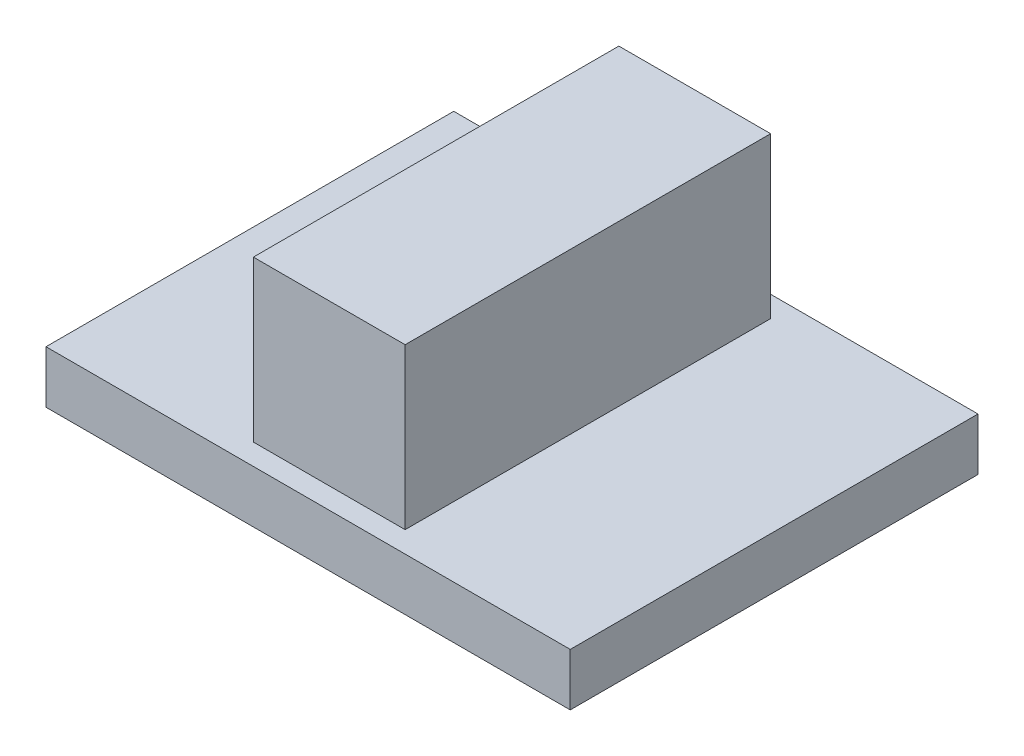
ISO-10303-21;
HEADER;
FILE_DESCRIPTION(('STEP AP214'),'2;1');
FILE_NAME('part.step','',(''),(''),'','','');
FILE_SCHEMA(('AUTOMOTIVE_DESIGN { 1 0 10303 214 1 1 1 1 }'));
ENDSEC;
DATA;
#1=APPLICATION_CONTEXT('core data for automotive mechanical design processes');
#2=APPLICATION_PROTOCOL_DEFINITION('international standard','automotive_design',2000,#1);
#3=PRODUCT_CONTEXT('',#1,'mechanical');
#4=PRODUCT('Part','Part','',(#3));
#5=PRODUCT_RELATED_PRODUCT_CATEGORY('part','',(#4));
#6=PRODUCT_DEFINITION_FORMATION('','',#4);
#7=PRODUCT_DEFINITION_CONTEXT('part definition',#1,'design');
#8=PRODUCT_DEFINITION('design','',#6,#7);
#9=PRODUCT_DEFINITION_SHAPE('','',#8);
#10=(LENGTH_UNIT() NAMED_UNIT(*) SI_UNIT(.MILLI.,.METRE.));
#11=(NAMED_UNIT(*) PLANE_ANGLE_UNIT() SI_UNIT($,.RADIAN.));
#12=(NAMED_UNIT(*) SI_UNIT($,.STERADIAN.) SOLID_ANGLE_UNIT());
#13=UNCERTAINTY_MEASURE_WITH_UNIT(LENGTH_MEASURE(1.E-05),#10,'distance_accuracy_value','');
#14=(GEOMETRIC_REPRESENTATION_CONTEXT(3) GLOBAL_UNCERTAINTY_ASSIGNED_CONTEXT((#13)) GLOBAL_UNIT_ASSIGNED_CONTEXT((#10,
#11,#12)) REPRESENTATION_CONTEXT('',''));
#15=CARTESIAN_POINT('',(0.,0.,0.));
#16=DIRECTION('',(0.,0.,1.));
#17=DIRECTION('',(1.,0.,0.));
#18=AXIS2_PLACEMENT_3D('',#15,#16,#17);
#19=CARTESIAN_POINT('',(0.,7.3,0.));
#20=DIRECTION('',(0.,-1.,0.));
#21=DIRECTION('',(0.,0.,-1.));
#22=AXIS2_PLACEMENT_3D('',#19,#20,#21);
#23=PLANE('',#22);
#24=DIRECTION('',(0.,0.,-1.));
#25=VECTOR('',#24,1.);
#26=CARTESIAN_POINT('',(2.6051126105191,7.3,6.2745090314332));
#27=LINE('',#26,#25);
#28=CARTESIAN_POINT('',(2.6051126105191,7.3,6.2745090314332));
#29=VERTEX_POINT('',#28);
#30=CARTESIAN_POINT('',(2.6051126105191,7.3,-6.2745090314332));
#31=VERTEX_POINT('',#30);
#32=EDGE_CURVE('E152',#29,#31,#27,.T.);
#33=ORIENTED_EDGE('',*,*,#32,.T.);
#34=DIRECTION('',(-1.,0.,0.));
#35=VECTOR('',#34,1.);
#36=CARTESIAN_POINT('',(-2.6051126105191,7.3,-6.2745090314332));
#37=LINE('',#36,#35);
#38=CARTESIAN_POINT('',(-2.6051126105191,7.3,-6.2745090314332));
#39=VERTEX_POINT('',#38);
#40=EDGE_CURVE('E149',#31,#39,#37,.T.);
#41=ORIENTED_EDGE('',*,*,#40,.T.);
#42=DIRECTION('',(0.,0.,1.));
#43=VECTOR('',#42,1.);
#44=CARTESIAN_POINT('',(-2.6051126105191,7.3,6.2745090314332));
#45=LINE('',#44,#43);
#46=CARTESIAN_POINT('',(-2.6051126105191,7.3,6.2745090314332));
#47=VERTEX_POINT('',#46);
#48=EDGE_CURVE('E26',#39,#47,#45,.T.);
#49=ORIENTED_EDGE('',*,*,#48,.T.);
#50=DIRECTION('',(1.,0.,0.));
#51=VECTOR('',#50,1.);
#52=CARTESIAN_POINT('',(-2.6051126105191,7.3,6.2745090314332));
#53=LINE('',#52,#51);
#54=EDGE_CURVE('E11',#47,#29,#53,.T.);
#55=ORIENTED_EDGE('',*,*,#54,.T.);
#56=EDGE_LOOP('',(#33,#41,#49,#55));
#57=FACE_BOUND('',#56,.T.);
#58=ADVANCED_FACE('F16',(#57),#23,.F.);
#59=CARTESIAN_POINT('',(-2.6051126105191,7.3,6.2745090314332));
#60=DIRECTION('',(0.,0.,-1.));
#61=DIRECTION('',(0.,-1.,0.));
#62=AXIS2_PLACEMENT_3D('',#59,#60,#61);
#63=PLANE('',#62);
#64=DIRECTION('',(1.,0.,0.));
#65=VECTOR('',#64,1.);
#66=CARTESIAN_POINT('',(-2.6051126105191,1.8,6.2745090314332));
#67=LINE('',#66,#65);
#68=CARTESIAN_POINT('',(-2.6051126105191,1.8,6.2745090314332));
#69=VERTEX_POINT('',#68);
#70=CARTESIAN_POINT('',(2.6051126105191,1.8,6.2745090314332));
#71=VERTEX_POINT('',#70);
#72=EDGE_CURVE('E178',#69,#71,#67,.T.);
#73=ORIENTED_EDGE('',*,*,#72,.T.);
#74=DIRECTION('',(0.,-1.,0.));
#75=VECTOR('',#74,1.);
#76=CARTESIAN_POINT('',(2.6051126105191,7.3,6.2745090314332));
#77=LINE('',#76,#75);
#78=EDGE_CURVE('E19',#29,#71,#77,.T.);
#79=ORIENTED_EDGE('',*,*,#78,.F.);
#80=ORIENTED_EDGE('',*,*,#54,.F.);
#81=DIRECTION('',(0.,-1.,0.));
#82=VECTOR('',#81,1.);
#83=CARTESIAN_POINT('',(-2.6051126105191,7.3,6.2745090314332));
#84=LINE('',#83,#82);
#85=EDGE_CURVE('E103',#47,#69,#84,.T.);
#86=ORIENTED_EDGE('',*,*,#85,.T.);
#87=EDGE_LOOP('',(#73,#79,#80,#86));
#88=FACE_BOUND('',#87,.T.);
#89=ADVANCED_FACE('F200',(#88),#63,.F.);
#90=CARTESIAN_POINT('',(-2.6051126105191,7.3,6.2745090314332));
#91=DIRECTION('',(1.,0.,0.));
#92=DIRECTION('',(0.,1.,0.));
#93=AXIS2_PLACEMENT_3D('',#90,#91,#92);
#94=PLANE('',#93);
#95=DIRECTION('',(0.,0.,1.));
#96=VECTOR('',#95,1.);
#97=CARTESIAN_POINT('',(-2.6051126105191,1.8,6.2745090314332));
#98=LINE('',#97,#96);
#99=CARTESIAN_POINT('',(-2.6051126105191,1.8,-6.2745090314332));
#100=VERTEX_POINT('',#99);
#101=EDGE_CURVE('E181',#100,#69,#98,.T.);
#102=ORIENTED_EDGE('',*,*,#101,.T.);
#103=ORIENTED_EDGE('',*,*,#85,.F.);
#104=ORIENTED_EDGE('',*,*,#48,.F.);
#105=DIRECTION('',(0.,-1.,0.));
#106=VECTOR('',#105,1.);
#107=CARTESIAN_POINT('',(-2.6051126105191,7.3,-6.2745090314332));
#108=LINE('',#107,#106);
#109=EDGE_CURVE('E161',#39,#100,#108,.T.);
#110=ORIENTED_EDGE('',*,*,#109,.T.);
#111=EDGE_LOOP('',(#102,#103,#104,#110));
#112=FACE_BOUND('',#111,.T.);
#113=ADVANCED_FACE('F194',(#112),#94,.F.);
#114=CARTESIAN_POINT('',(-2.6051126105191,7.3,-6.2745090314332));
#115=DIRECTION('',(0.,0.,1.));
#116=DIRECTION('',(1.,0.,0.));
#117=AXIS2_PLACEMENT_3D('',#114,#115,#116);
#118=PLANE('',#117);
#119=DIRECTION('',(-1.,0.,0.));
#120=VECTOR('',#119,1.);
#121=CARTESIAN_POINT('',(-2.6051126105191,1.8,-6.2745090314332));
#122=LINE('',#121,#120);
#123=CARTESIAN_POINT('',(2.6051126105191,1.8,-6.2745090314332));
#124=VERTEX_POINT('',#123);
#125=EDGE_CURVE('E171',#124,#100,#122,.T.);
#126=ORIENTED_EDGE('',*,*,#125,.T.);
#127=ORIENTED_EDGE('',*,*,#109,.F.);
#128=ORIENTED_EDGE('',*,*,#40,.F.);
#129=DIRECTION('',(0.,-1.,0.));
#130=VECTOR('',#129,1.);
#131=CARTESIAN_POINT('',(2.6051126105191,7.3,-6.2745090314332));
#132=LINE('',#131,#130);
#133=EDGE_CURVE('E93',#31,#124,#132,.T.);
#134=ORIENTED_EDGE('',*,*,#133,.T.);
#135=EDGE_LOOP('',(#126,#127,#128,#134));
#136=FACE_BOUND('',#135,.T.);
#137=ADVANCED_FACE('F191',(#136),#118,.F.);
#138=CARTESIAN_POINT('',(2.6051126105191,7.3,6.2745090314332));
#139=DIRECTION('',(-1.,0.,0.));
#140=DIRECTION('',(0.,0.,1.));
#141=AXIS2_PLACEMENT_3D('',#138,#139,#140);
#142=PLANE('',#141);
#143=DIRECTION('',(0.,0.,-1.));
#144=VECTOR('',#143,1.);
#145=CARTESIAN_POINT('',(2.6051126105191,1.8,6.2745090314332));
#146=LINE('',#145,#144);
#147=EDGE_CURVE('E182',#71,#124,#146,.T.);
#148=ORIENTED_EDGE('',*,*,#147,.T.);
#149=ORIENTED_EDGE('',*,*,#133,.F.);
#150=ORIENTED_EDGE('',*,*,#32,.F.);
#151=ORIENTED_EDGE('',*,*,#78,.T.);
#152=EDGE_LOOP('',(#148,#149,#150,#151));
#153=FACE_BOUND('',#152,.T.);
#154=ADVANCED_FACE('F202',(#153),#142,.F.);
#155=CARTESIAN_POINT('',(0.,0.,0.));
#156=DIRECTION('',(0.,-1.,0.));
#157=DIRECTION('',(0.,0.,-1.));
#158=AXIS2_PLACEMENT_3D('',#155,#156,#157);
#159=PLANE('',#158);
#160=DIRECTION('',(0.,0.,-1.));
#161=VECTOR('',#160,1.);
#162=CARTESIAN_POINT('',(9.,0.,7.));
#163=LINE('',#162,#161);
#164=CARTESIAN_POINT('',(9.,0.,7.));
#165=VERTEX_POINT('',#164);
#166=CARTESIAN_POINT('',(9.,0.,-7.));
#167=VERTEX_POINT('',#166);
#168=EDGE_CURVE('E120',#165,#167,#163,.T.);
#169=ORIENTED_EDGE('',*,*,#168,.F.);
#170=DIRECTION('',(1.,0.,0.));
#171=VECTOR('',#170,1.);
#172=CARTESIAN_POINT('',(-9.,0.,7.));
#173=LINE('',#172,#171);
#174=CARTESIAN_POINT('',(-9.,0.,7.));
#175=VERTEX_POINT('',#174);
#176=EDGE_CURVE('E150',#175,#165,#173,.T.);
#177=ORIENTED_EDGE('',*,*,#176,.F.);
#178=DIRECTION('',(0.,0.,1.));
#179=VECTOR('',#178,1.);
#180=CARTESIAN_POINT('',(-9.,0.,7.));
#181=LINE('',#180,#179);
#182=CARTESIAN_POINT('',(-9.,0.,-7.));
#183=VERTEX_POINT('',#182);
#184=EDGE_CURVE('E410',#183,#175,#181,.T.);
#185=ORIENTED_EDGE('',*,*,#184,.F.);
#186=DIRECTION('',(-1.,0.,0.));
#187=VECTOR('',#186,1.);
#188=CARTESIAN_POINT('',(-9.,0.,-7.));
#189=LINE('',#188,#187);
#190=EDGE_CURVE('E177',#167,#183,#189,.T.);
#191=ORIENTED_EDGE('',*,*,#190,.F.);
#192=EDGE_LOOP('',(#169,#177,#185,#191));
#193=FACE_BOUND('',#192,.T.);
#194=ADVANCED_FACE('F352',(#193),#159,.T.);
#195=CARTESIAN_POINT('',(-9.,1.8,7.));
#196=DIRECTION('',(0.,0.,-1.));
#197=DIRECTION('',(0.,-1.,0.));
#198=AXIS2_PLACEMENT_3D('',#195,#196,#197);
#199=PLANE('',#198);
#200=ORIENTED_EDGE('',*,*,#176,.T.);
#201=DIRECTION('',(0.,-1.,0.));
#202=VECTOR('',#201,1.);
#203=CARTESIAN_POINT('',(9.,1.8,7.));
#204=LINE('',#203,#202);
#205=CARTESIAN_POINT('',(9.,1.8,7.));
#206=VERTEX_POINT('',#205);
#207=EDGE_CURVE('E124',#206,#165,#204,.T.);
#208=ORIENTED_EDGE('',*,*,#207,.F.);
#209=DIRECTION('',(1.,0.,0.));
#210=VECTOR('',#209,1.);
#211=CARTESIAN_POINT('',(-9.,1.8,7.));
#212=LINE('',#211,#210);
#213=CARTESIAN_POINT('',(-9.,1.8,7.));
#214=VERTEX_POINT('',#213);
#215=EDGE_CURVE('E140',#214,#206,#212,.T.);
#216=ORIENTED_EDGE('',*,*,#215,.F.);
#217=DIRECTION('',(0.,-1.,0.));
#218=VECTOR('',#217,1.);
#219=CARTESIAN_POINT('',(-9.,1.8,7.));
#220=LINE('',#219,#218);
#221=EDGE_CURVE('E151',#214,#175,#220,.T.);
#222=ORIENTED_EDGE('',*,*,#221,.T.);
#223=EDGE_LOOP('',(#200,#208,#216,#222));
#224=FACE_BOUND('',#223,.T.);
#225=ADVANCED_FACE('F325',(#224),#199,.F.);
#226=CARTESIAN_POINT('',(-9.,1.8,7.));
#227=DIRECTION('',(1.,0.,0.));
#228=DIRECTION('',(0.,1.,0.));
#229=AXIS2_PLACEMENT_3D('',#226,#227,#228);
#230=PLANE('',#229);
#231=ORIENTED_EDGE('',*,*,#184,.T.);
#232=ORIENTED_EDGE('',*,*,#221,.F.);
#233=DIRECTION('',(0.,0.,1.));
#234=VECTOR('',#233,1.);
#235=CARTESIAN_POINT('',(-9.,1.8,7.));
#236=LINE('',#235,#234);
#237=CARTESIAN_POINT('',(-9.,1.8,-7.));
#238=VERTEX_POINT('',#237);
#239=EDGE_CURVE('E135',#238,#214,#236,.T.);
#240=ORIENTED_EDGE('',*,*,#239,.F.);
#241=DIRECTION('',(0.,-1.,0.));
#242=VECTOR('',#241,1.);
#243=CARTESIAN_POINT('',(-9.,1.8,-7.));
#244=LINE('',#243,#242);
#245=EDGE_CURVE('E130',#238,#183,#244,.T.);
#246=ORIENTED_EDGE('',*,*,#245,.T.);
#247=EDGE_LOOP('',(#231,#232,#240,#246));
#248=FACE_BOUND('',#247,.T.);
#249=ADVANCED_FACE('F317',(#248),#230,.F.);
#250=CARTESIAN_POINT('',(-9.,1.8,-7.));
#251=DIRECTION('',(0.,0.,1.));
#252=DIRECTION('',(1.,0.,0.));
#253=AXIS2_PLACEMENT_3D('',#250,#251,#252);
#254=PLANE('',#253);
#255=ORIENTED_EDGE('',*,*,#190,.T.);
#256=ORIENTED_EDGE('',*,*,#245,.F.);
#257=DIRECTION('',(-1.,0.,0.));
#258=VECTOR('',#257,1.);
#259=CARTESIAN_POINT('',(-9.,1.8,-7.));
#260=LINE('',#259,#258);
#261=CARTESIAN_POINT('',(9.,1.8,-7.));
#262=VERTEX_POINT('',#261);
#263=EDGE_CURVE('E127',#262,#238,#260,.T.);
#264=ORIENTED_EDGE('',*,*,#263,.F.);
#265=DIRECTION('',(0.,-1.,0.));
#266=VECTOR('',#265,1.);
#267=CARTESIAN_POINT('',(9.,1.8,-7.));
#268=LINE('',#267,#266);
#269=EDGE_CURVE('E113',#262,#167,#268,.T.);
#270=ORIENTED_EDGE('',*,*,#269,.T.);
#271=EDGE_LOOP('',(#255,#256,#264,#270));
#272=FACE_BOUND('',#271,.T.);
#273=ADVANCED_FACE('F128',(#272),#254,.F.);
#274=CARTESIAN_POINT('',(9.,1.8,7.));
#275=DIRECTION('',(-1.,0.,0.));
#276=DIRECTION('',(0.,0.,1.));
#277=AXIS2_PLACEMENT_3D('',#274,#275,#276);
#278=PLANE('',#277);
#279=ORIENTED_EDGE('',*,*,#168,.T.);
#280=ORIENTED_EDGE('',*,*,#269,.F.);
#281=DIRECTION('',(0.,0.,-1.));
#282=VECTOR('',#281,1.);
#283=CARTESIAN_POINT('',(9.,1.8,7.));
#284=LINE('',#283,#282);
#285=EDGE_CURVE('E118',#206,#262,#284,.T.);
#286=ORIENTED_EDGE('',*,*,#285,.F.);
#287=ORIENTED_EDGE('',*,*,#207,.T.);
#288=EDGE_LOOP('',(#279,#280,#286,#287));
#289=FACE_BOUND('',#288,.T.);
#290=ADVANCED_FACE('F115',(#289),#278,.F.);
#291=CARTESIAN_POINT('',(0.,1.8,0.));
#292=DIRECTION('',(0.,-1.,0.));
#293=DIRECTION('',(0.,0.,-1.));
#294=AXIS2_PLACEMENT_3D('',#291,#292,#293);
#295=PLANE('',#294);
#296=ORIENTED_EDGE('',*,*,#147,.F.);
#297=ORIENTED_EDGE('',*,*,#72,.F.);
#298=ORIENTED_EDGE('',*,*,#101,.F.);
#299=ORIENTED_EDGE('',*,*,#125,.F.);
#300=EDGE_LOOP('',(#296,#297,#298,#299));
#301=FACE_BOUND('',#300,.T.);
#302=ORIENTED_EDGE('',*,*,#285,.T.);
#303=ORIENTED_EDGE('',*,*,#263,.T.);
#304=ORIENTED_EDGE('',*,*,#239,.T.);
#305=ORIENTED_EDGE('',*,*,#215,.T.);
#306=EDGE_LOOP('',(#302,#303,#304,#305));
#307=FACE_BOUND('',#306,.T.);
#308=ADVANCED_FACE('F138',(#301,#307),#295,.F.);
#309=CLOSED_SHELL('',(#58,#89,#113,#137,#154,#194,#225,#249,#273,#290,#308));
#310=MANIFOLD_SOLID_BREP('B1',#309);
#311=ADVANCED_BREP_SHAPE_REPRESENTATION('',(#18,#310),#14);
#312=SHAPE_DEFINITION_REPRESENTATION(#9,#311);
ENDSEC;
END-ISO-10303-21;
